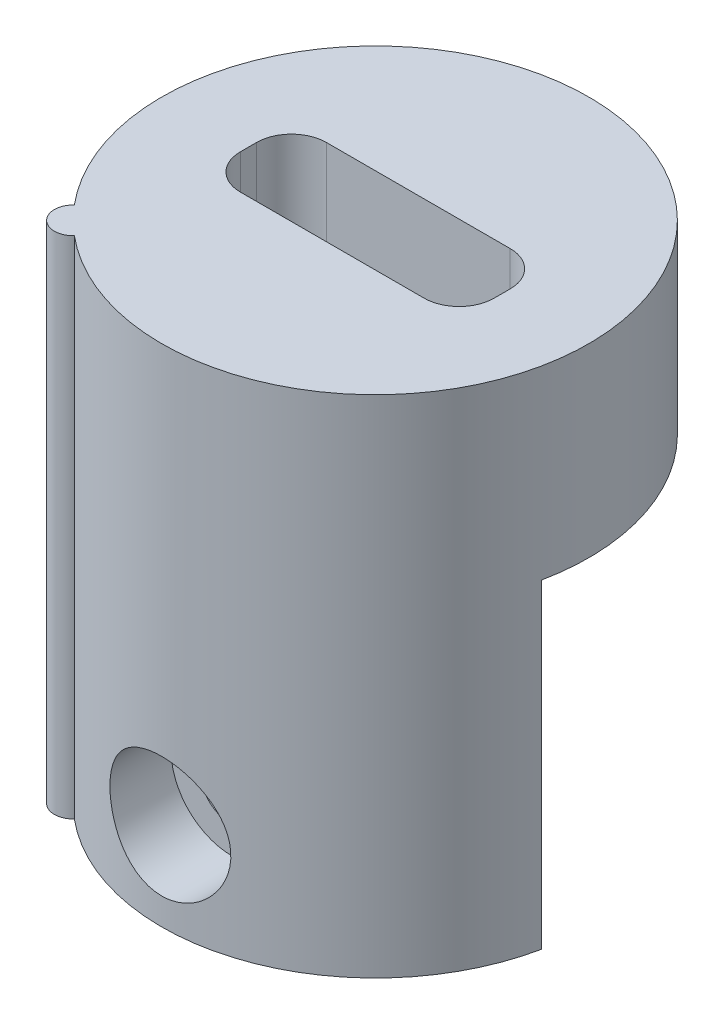
ISO-10303-21;
HEADER;
FILE_DESCRIPTION(('STEP AP214'),'2;1');
FILE_NAME('part.step','',(''),(''),'','','');
FILE_SCHEMA(('AUTOMOTIVE_DESIGN { 1 0 10303 214 1 1 1 1 }'));
ENDSEC;
DATA;
#1=APPLICATION_CONTEXT('core data for automotive mechanical design processes');
#2=APPLICATION_PROTOCOL_DEFINITION('international standard','automotive_design',2000,#1);
#3=PRODUCT_CONTEXT('',#1,'mechanical');
#4=PRODUCT('Part','Part','',(#3));
#5=PRODUCT_RELATED_PRODUCT_CATEGORY('part','',(#4));
#6=PRODUCT_DEFINITION_FORMATION('','',#4);
#7=PRODUCT_DEFINITION_CONTEXT('part definition',#1,'design');
#8=PRODUCT_DEFINITION('design','',#6,#7);
#9=PRODUCT_DEFINITION_SHAPE('','',#8);
#10=(LENGTH_UNIT() NAMED_UNIT(*) SI_UNIT(.MILLI.,.METRE.));
#11=(NAMED_UNIT(*) PLANE_ANGLE_UNIT() SI_UNIT($,.RADIAN.));
#12=(NAMED_UNIT(*) SI_UNIT($,.STERADIAN.) SOLID_ANGLE_UNIT());
#13=UNCERTAINTY_MEASURE_WITH_UNIT(LENGTH_MEASURE(1.E-05),#10,'distance_accuracy_value','');
#14=(GEOMETRIC_REPRESENTATION_CONTEXT(3) GLOBAL_UNCERTAINTY_ASSIGNED_CONTEXT((#13)) GLOBAL_UNIT_ASSIGNED_CONTEXT((#10,
#11,#12)) REPRESENTATION_CONTEXT('',''));
#15=CARTESIAN_POINT('',(0.,0.,0.));
#16=DIRECTION('',(0.,0.,1.));
#17=DIRECTION('',(1.,0.,0.));
#18=AXIS2_PLACEMENT_3D('',#15,#16,#17);
#19=CARTESIAN_POINT('',(0.,37.9987213115874,0.));
#20=DIRECTION('',(0.,-1.,0.));
#21=DIRECTION('',(0.,0.,-1.));
#22=AXIS2_PLACEMENT_3D('',#19,#20,#21);
#23=CYLINDRICAL_SURFACE('',#22,7.05);
#24=DIRECTION('',(0.,-1.,0.));
#25=VECTOR('',#24,1.);
#26=CARTESIAN_POINT('',(-6.86603961538236,37.9987213115874,1.6));
#27=LINE('',#26,#25);
#28=CARTESIAN_POINT('',(-6.86603961538236,11.9,1.6));
#29=VERTEX_POINT('',#28);
#30=CARTESIAN_POINT('',(-6.86603961538236,0.,1.6));
#31=VERTEX_POINT('',#30);
#32=EDGE_CURVE('E198',#29,#31,#27,.T.);
#33=ORIENTED_EDGE('',*,*,#32,.F.);
#34=CARTESIAN_POINT('',(0.,11.9,0.));
#35=DIRECTION('',(0.,1.,0.));
#36=DIRECTION('',(0.,0.,1.));
#37=AXIS2_PLACEMENT_3D('',#34,#35,#36);
#38=CIRCLE('',#37,7.05);
#39=CARTESIAN_POINT('',(6.86603961538236,11.9,1.6));
#40=VERTEX_POINT('',#39);
#41=EDGE_CURVE('E205',#29,#40,#38,.T.);
#42=ORIENTED_EDGE('',*,*,#41,.T.);
#43=DIRECTION('',(0.,-1.,0.));
#44=VECTOR('',#43,1.);
#45=CARTESIAN_POINT('',(6.86603961538236,37.9987213115874,1.6));
#46=LINE('',#45,#44);
#47=CARTESIAN_POINT('',(6.86603961538236,0.,1.6));
#48=VERTEX_POINT('',#47);
#49=EDGE_CURVE('E192',#48,#40,#46,.F.);
#50=ORIENTED_EDGE('',*,*,#49,.F.);
#51=CARTESIAN_POINT('',(0.,0.,0.));
#52=DIRECTION('',(0.,1.,0.));
#53=DIRECTION('',(0.,0.,1.));
#54=AXIS2_PLACEMENT_3D('',#51,#52,#53);
#55=CIRCLE('',#54,7.05);
#56=CARTESIAN_POINT('',(2.25,0.,6.68131723539603));
#57=VERTEX_POINT('',#56);
#58=EDGE_CURVE('E216',#57,#48,#55,.T.);
#59=ORIENTED_EDGE('',*,*,#58,.F.);
#60=DIRECTION('',(0.,-1.,0.));
#61=VECTOR('',#60,1.);
#62=CARTESIAN_POINT('',(2.25,6.4,6.68131723539603));
#63=LINE('',#62,#61);
#64=CARTESIAN_POINT('',(2.25,1.1408739718026,6.68131723539603));
#65=VERTEX_POINT('',#64);
#66=EDGE_CURVE('E320',#65,#57,#63,.T.);
#67=ORIENTED_EDGE('',*,*,#66,.F.);
#68=CARTESIAN_POINT('',(1.66733320005331,5.75391855782443,6.85));
#69=CARTESIAN_POINT('',(1.74060140182328,5.70607955480565,6.83216920240075));
#70=CARTESIAN_POINT('',(1.81164965876598,5.65520244872874,6.81362663385331));
#71=CARTESIAN_POINT('',(1.94896923535859,5.54768684113123,6.77562446894652));
#72=CARTESIAN_POINT('',(2.0152411243713,5.49104902825796,6.75616498234646));
#73=CARTESIAN_POINT('',(2.20656817877217,5.31280312894442,6.69711589323302));
#74=CARTESIAN_POINT('',(2.32395389828211,5.18298108772871,6.65690174010533));
#75=CARTESIAN_POINT('',(2.53520422911894,4.90464448061897,6.57935839425873));
#76=CARTESIAN_POINT('',(2.62905765286788,4.75612107405074,6.5420305795551));
#77=CARTESIAN_POINT('',(2.79034668981263,4.44388905276111,6.47488366750186));
#78=CARTESIAN_POINT('',(2.8578108066843,4.28019705975398,6.44505648106713));
#79=CARTESIAN_POINT('',(2.96190910147016,3.94761464935933,6.39787391541724));
#80=CARTESIAN_POINT('',(2.9994952177959,3.77907892422389,6.3801362556086));
#81=CARTESIAN_POINT('',(3.04563958401764,3.43722082276321,6.35824453569025));
#82=CARTESIAN_POINT('',(3.05421291189618,3.26390097998265,6.35408341987395));
#83=CARTESIAN_POINT('',(3.04245670626433,2.93398896452825,6.35971334303641));
#84=CARTESIAN_POINT('',(3.02462819465739,2.77727913237544,6.36829725251299));
#85=CARTESIAN_POINT('',(2.96535289182804,2.46940972846357,6.39611133477086));
#86=CARTESIAN_POINT('',(2.92390574090669,2.31825024127054,6.41534166969124));
#87=CARTESIAN_POINT('',(2.81865239787285,2.02431760018763,6.46227556856702));
#88=CARTESIAN_POINT('',(2.75471045990992,1.88160164823009,6.49003044217454));
#89=CARTESIAN_POINT('',(2.60644252961961,1.60840888666788,6.55098326925265));
#90=CARTESIAN_POINT('',(2.52210065074101,1.47794172632928,6.5841854583318));
#91=CARTESIAN_POINT('',(2.32308645913269,1.21604529373514,6.65720071242586));
#92=CARTESIAN_POINT('',(2.20593101782435,1.08656787115998,6.69731953188111));
#93=CARTESIAN_POINT('',(2.01493723609454,0.908685675557565,6.7562552501142));
#94=CARTESIAN_POINT('',(1.94871608550168,0.852105334203414,6.77569674754619));
#95=CARTESIAN_POINT('',(1.81151362170668,0.744700671307594,6.81366205077588));
#96=CARTESIAN_POINT('',(1.74053223068432,0.693876443903178,6.83218584156235));
#97=CARTESIAN_POINT('',(1.66733320005331,0.646081442175573,6.85));
#98=B_SPLINE_CURVE_WITH_KNOTS('',3,(#68,#69,#70,#71,#72,#73,#74,#75,#76,#77,#78,#79,#80,#81,#82,
#83,#84,#85,#86,#87,#88,#89,#90,#91,#92,#93,#94,#95,#96,#97),.UNSPECIFIED.,.F.,.F.,(4,2,2,2,2,2,
2,2,2,2,2,2,2,2,4),(0.,0.267724403057944,0.535416839293612,1.07145655450831,1.6077506292482,
2.14346383067559,2.66133550981283,3.17893800902237,3.65053860870523,4.12214639079864,
4.59665036006512,5.071525048092,5.60626041279744,5.87372313705406,6.14119023484664),.UNSPECIFIED.);
#99=CARTESIAN_POINT('',(2.25,5.2591260281974,6.68131723539603));
#100=VERTEX_POINT('',#99);
#101=EDGE_CURVE('E305',#100,#65,#98,.T.);
#102=ORIENTED_EDGE('',*,*,#101,.F.);
#103=CARTESIAN_POINT('',(2.25,10.231317235396,6.68131723539602));
#104=VERTEX_POINT('',#103);
#105=EDGE_CURVE('E66',#104,#100,#63,.T.);
#106=ORIENTED_EDGE('',*,*,#105,.F.);
#107=CARTESIAN_POINT('',(0.,3.55000000000003,0.));
#108=DIRECTION('',(0.,0.707106781186551,-0.707106781186544));
#109=DIRECTION('',(0.,-0.707106781186544,-0.707106781186551));
#110=AXIS2_PLACEMENT_3D('',#107,#108,#109);
#111=ELLIPSE('',#110,9.97020561473027,7.05);
#112=CARTESIAN_POINT('',(-2.25,10.231317235396,6.68131723539602));
#113=VERTEX_POINT('',#112);
#114=EDGE_CURVE('E379',#113,#104,#111,.T.);
#115=ORIENTED_EDGE('',*,*,#114,.F.);
#116=DIRECTION('',(0.,-1.,0.));
#117=VECTOR('',#116,1.);
#118=CARTESIAN_POINT('',(-2.25,6.4,6.68131723539603));
#119=LINE('',#118,#117);
#120=CARTESIAN_POINT('',(-2.25,5.2591260281974,6.68131723539603));
#121=VERTEX_POINT('',#120);
#122=EDGE_CURVE('E327',#113,#121,#119,.T.);
#123=ORIENTED_EDGE('',*,*,#122,.T.);
#124=CARTESIAN_POINT('',(-1.66733320005331,0.646081442175573,6.85));
#125=CARTESIAN_POINT('',(-1.74060140182328,0.693920445194346,6.83216920240076));
#126=CARTESIAN_POINT('',(-1.81164965876598,0.74479755127126,6.81362663385331));
#127=CARTESIAN_POINT('',(-1.94896923535859,0.852313158868773,6.77562446894652));
#128=CARTESIAN_POINT('',(-2.0152411243713,0.908950971742036,6.75616498234646));
#129=CARTESIAN_POINT('',(-2.20656817877217,1.08719687105558,6.69711589323302));
#130=CARTESIAN_POINT('',(-2.32395389828211,1.21701891227129,6.65690174010533));
#131=CARTESIAN_POINT('',(-2.53520422911894,1.49535551938103,6.57935839425873));
#132=CARTESIAN_POINT('',(-2.62905765286789,1.64387892594926,6.5420305795551));
#133=CARTESIAN_POINT('',(-2.79034668981263,1.9561109472389,6.47488366750186));
#134=CARTESIAN_POINT('',(-2.8578108066843,2.11980294024602,6.44505648106713));
#135=CARTESIAN_POINT('',(-2.96190910147016,2.45238535064067,6.39787391541724));
#136=CARTESIAN_POINT('',(-2.9994952177959,2.62092107577611,6.3801362556086));
#137=CARTESIAN_POINT('',(-3.04563958401764,2.96277917723679,6.35824453569025));
#138=CARTESIAN_POINT('',(-3.05421291189618,3.13609902001735,6.35408341987395));
#139=CARTESIAN_POINT('',(-3.04245670626433,3.46601103547176,6.35971334303641));
#140=CARTESIAN_POINT('',(-3.02462819465739,3.62272086762456,6.36829725251299));
#141=CARTESIAN_POINT('',(-2.96535289182803,3.93059027153643,6.39611133477086));
#142=CARTESIAN_POINT('',(-2.92390574090669,4.08174975872947,6.41534166969124));
#143=CARTESIAN_POINT('',(-2.81865239787285,4.37568239981238,6.46227556856702));
#144=CARTESIAN_POINT('',(-2.75471045990992,4.51839835176991,6.49003044217454));
#145=CARTESIAN_POINT('',(-2.60644252961961,4.79159111333212,6.55098326925265));
#146=CARTESIAN_POINT('',(-2.52210065074101,4.92205827367072,6.5841854583318));
#147=CARTESIAN_POINT('',(-2.32308645913269,5.18395470626487,6.65720071242586));
#148=CARTESIAN_POINT('',(-2.20593101782435,5.31343212884002,6.69731953188111));
#149=CARTESIAN_POINT('',(-2.01493723609454,5.49131432444244,6.7562552501142));
#150=CARTESIAN_POINT('',(-1.94871608550168,5.54789466579659,6.77569674754619));
#151=CARTESIAN_POINT('',(-1.81151362170667,5.65529932869241,6.81366205077588));
#152=CARTESIAN_POINT('',(-1.74053223068431,5.70612355609682,6.83218584156235));
#153=CARTESIAN_POINT('',(-1.6673332000533,5.75391855782443,6.85));
#154=B_SPLINE_CURVE_WITH_KNOTS('',3,(#124,#125,#126,#127,#128,#129,#130,#131,#132,#133,#134,
#135,#136,#137,#138,#139,#140,#141,#142,#143,#144,#145,#146,#147,#148,#149,#150,#151,#152,#153),
.UNSPECIFIED.,.F.,.F.,(4,2,2,2,2,2,2,2,2,2,2,2,2,2,4),(0.,0.267724403057944,0.535416839293612,
1.07145655450831,1.60775062924821,2.14346383067559,2.66133550981283,3.17893800902238,
3.65053860870523,4.12214639079864,4.59665036006512,5.07152504809201,5.60626041279744,
5.87372313705406,6.14119023484664),.UNSPECIFIED.);
#155=CARTESIAN_POINT('',(-2.25,1.1408739718026,6.68131723539603));
#156=VERTEX_POINT('',#155);
#157=EDGE_CURVE('E346',#156,#121,#154,.T.);
#158=ORIENTED_EDGE('',*,*,#157,.F.);
#159=CARTESIAN_POINT('',(-2.25,0.,6.68131723539603));
#160=VERTEX_POINT('',#159);
#161=EDGE_CURVE('E326',#156,#160,#119,.T.);
#162=ORIENTED_EDGE('',*,*,#161,.T.);
#163=EDGE_CURVE('E213',#31,#160,#55,.T.);
#164=ORIENTED_EDGE('',*,*,#163,.F.);
#165=EDGE_LOOP('',(#33,#42,#50,#59,#67,#102,#106,#115,#123,#158,#162,#164));
#166=FACE_BOUND('',#165,.T.);
#167=ADVANCED_FACE('F39',(#166),#23,.F.);
#168=CARTESIAN_POINT('',(-2.25,6.4,0.));
#169=DIRECTION('',(1.,0.,0.));
#170=DIRECTION('',(0.,0.,-1.));
#171=AXIS2_PLACEMENT_3D('',#168,#169,#170);
#172=PLANE('',#171);
#173=ORIENTED_EDGE('',*,*,#161,.F.);
#174=DIRECTION('',(0.,0.,-1.));
#175=VECTOR('',#174,1.);
#176=CARTESIAN_POINT('',(-2.25,1.1408739718026,6.85));
#177=LINE('',#176,#175);
#178=CARTESIAN_POINT('',(-2.25,1.1408739718026,2.85));
#179=VERTEX_POINT('',#178);
#180=EDGE_CURVE('E338',#156,#179,#177,.T.);
#181=ORIENTED_EDGE('',*,*,#180,.T.);
#182=DIRECTION('',(0.,-1.,0.));
#183=VECTOR('',#182,1.);
#184=CARTESIAN_POINT('',(-2.25,6.4,2.85));
#185=LINE('',#184,#183);
#186=CARTESIAN_POINT('',(-2.25,0.,2.85));
#187=VERTEX_POINT('',#186);
#188=EDGE_CURVE('E218',#179,#187,#185,.T.);
#189=ORIENTED_EDGE('',*,*,#188,.T.);
#190=DIRECTION('',(0.,0.,1.));
#191=VECTOR('',#190,1.);
#192=CARTESIAN_POINT('',(-2.25,0.,0.));
#193=LINE('',#192,#191);
#194=EDGE_CURVE('E322',#187,#160,#193,.T.);
#195=ORIENTED_EDGE('',*,*,#194,.T.);
#196=EDGE_LOOP('',(#173,#181,#189,#195));
#197=FACE_BOUND('',#196,.T.);
#198=ADVANCED_FACE('F461',(#197),#172,.F.);
#199=CARTESIAN_POINT('',(2.25,6.4,0.));
#200=DIRECTION('',(1.,0.,0.));
#201=DIRECTION('',(0.,0.,-1.));
#202=AXIS2_PLACEMENT_3D('',#199,#200,#201);
#203=PLANE('',#202);
#204=DIRECTION('',(0.,0.,-1.));
#205=VECTOR('',#204,1.);
#206=CARTESIAN_POINT('',(2.25,1.1408739718026,6.85));
#207=LINE('',#206,#205);
#208=CARTESIAN_POINT('',(2.25,1.1408739718026,2.85));
#209=VERTEX_POINT('',#208);
#210=EDGE_CURVE('E51',#65,#209,#207,.T.);
#211=ORIENTED_EDGE('',*,*,#210,.F.);
#212=ORIENTED_EDGE('',*,*,#66,.T.);
#213=DIRECTION('',(0.,0.,1.));
#214=VECTOR('',#213,1.);
#215=CARTESIAN_POINT('',(2.25,0.,0.));
#216=LINE('',#215,#214);
#217=CARTESIAN_POINT('',(2.25,0.,2.85));
#218=VERTEX_POINT('',#217);
#219=EDGE_CURVE('E313',#218,#57,#216,.T.);
#220=ORIENTED_EDGE('',*,*,#219,.F.);
#221=DIRECTION('',(0.,-1.,0.));
#222=VECTOR('',#221,1.);
#223=CARTESIAN_POINT('',(2.25,6.4,2.85));
#224=LINE('',#223,#222);
#225=EDGE_CURVE('E310',#209,#218,#224,.T.);
#226=ORIENTED_EDGE('',*,*,#225,.F.);
#227=EDGE_LOOP('',(#211,#212,#220,#226));
#228=FACE_BOUND('',#227,.T.);
#229=ADVANCED_FACE('F311',(#228),#203,.T.);
#230=CARTESIAN_POINT('',(-2.8107494552165,0.,2.81074945521655));
#231=DIRECTION('',(0.,1.,0.));
#232=DIRECTION('',(0.,0.,1.));
#233=AXIS2_PLACEMENT_3D('',#230,#231,#232);
#234=PLANE('',#233);
#235=CARTESIAN_POINT('',(0.,0.,0.));
#236=DIRECTION('',(0.,1.,0.));
#237=DIRECTION('',(0.,0.,1.));
#238=AXIS2_PLACEMENT_3D('',#235,#236,#237);
#239=CIRCLE('',#238,7.95);
#240=CARTESIAN_POINT('',(-7.7873294523861,0.,1.6));
#241=VERTEX_POINT('',#240);
#242=CARTESIAN_POINT('',(-6.09420239994207,0.,5.10521273881317));
#243=VERTEX_POINT('',#242);
#244=EDGE_CURVE('E287',#241,#243,#239,.T.);
#245=ORIENTED_EDGE('',*,*,#244,.F.);
#246=DIRECTION('',(-1.,0.,0.));
#247=VECTOR('',#246,1.);
#248=CARTESIAN_POINT('',(7.95,0.,1.6));
#249=LINE('',#248,#247);
#250=EDGE_CURVE('E392',#31,#241,#249,.T.);
#251=ORIENTED_EDGE('',*,*,#250,.F.);
#252=ORIENTED_EDGE('',*,*,#163,.T.);
#253=ORIENTED_EDGE('',*,*,#194,.F.);
#254=DIRECTION('',(-1.,0.,0.));
#255=VECTOR('',#254,1.);
#256=CARTESIAN_POINT('',(0.,0.,2.85));
#257=LINE('',#256,#255);
#258=EDGE_CURVE('E333',#218,#187,#257,.T.);
#259=ORIENTED_EDGE('',*,*,#258,.F.);
#260=ORIENTED_EDGE('',*,*,#219,.T.);
#261=ORIENTED_EDGE('',*,*,#58,.T.);
#262=CARTESIAN_POINT('',(7.7873294523861,0.,1.6));
#263=VERTEX_POINT('',#262);
#264=EDGE_CURVE('E195',#263,#48,#249,.T.);
#265=ORIENTED_EDGE('',*,*,#264,.F.);
#266=CARTESIAN_POINT('',(-5.10521273881307,0.,6.09420239994215));
#267=VERTEX_POINT('',#266);
#268=EDGE_CURVE('E282',#267,#263,#239,.T.);
#269=ORIENTED_EDGE('',*,*,#268,.F.);
#270=CARTESIAN_POINT('',(-5.621498910433,0.,5.6214989104331));
#271=DIRECTION('',(0.,1.,0.));
#272=DIRECTION('',(0.,0.,1.));
#273=AXIS2_PLACEMENT_3D('',#270,#271,#272);
#274=CIRCLE('',#273,0.7);
#275=EDGE_CURVE('E277',#243,#267,#274,.T.);
#276=ORIENTED_EDGE('',*,*,#275,.F.);
#277=EDGE_LOOP('',(#245,#251,#252,#253,#259,#260,#261,#265,#269,#276));
#278=FACE_BOUND('',#277,.T.);
#279=ADVANCED_FACE('F403',(#278),#234,.F.);
#280=CARTESIAN_POINT('',(-2.8107494552165,18.8,2.81074945521655));
#281=DIRECTION('',(0.,1.,0.));
#282=DIRECTION('',(0.,0.,1.));
#283=AXIS2_PLACEMENT_3D('',#280,#281,#282);
#284=PLANE('',#283);
#285=CARTESIAN_POINT('',(-5.621498910433,18.8,5.6214989104331));
#286=DIRECTION('',(0.,1.,0.));
#287=DIRECTION('',(0.,0.,1.));
#288=AXIS2_PLACEMENT_3D('',#285,#286,#287);
#289=CIRCLE('',#288,0.7);
#290=CARTESIAN_POINT('',(-6.09420239994207,18.8,5.10521273881317));
#291=VERTEX_POINT('',#290);
#292=CARTESIAN_POINT('',(-5.10521273881307,18.8,6.09420239994215));
#293=VERTEX_POINT('',#292);
#294=EDGE_CURVE('E278',#291,#293,#289,.T.);
#295=ORIENTED_EDGE('',*,*,#294,.T.);
#296=CARTESIAN_POINT('',(0.,18.8,0.));
#297=DIRECTION('',(0.,1.,0.));
#298=DIRECTION('',(0.,0.,1.));
#299=AXIS2_PLACEMENT_3D('',#296,#297,#298);
#300=CIRCLE('',#299,7.95);
#301=EDGE_CURVE('E281',#293,#291,#300,.T.);
#302=ORIENTED_EDGE('',*,*,#301,.T.);
#303=EDGE_LOOP('',(#295,#302));
#304=FACE_BOUND('',#303,.T.);
#305=DIRECTION('',(-1.,0.,0.));
#306=VECTOR('',#305,1.);
#307=CARTESIAN_POINT('',(-3.42,18.8,-1.6));
#308=LINE('',#307,#306);
#309=CARTESIAN_POINT('',(3.42,18.8,-1.6));
#310=VERTEX_POINT('',#309);
#311=CARTESIAN_POINT('',(-3.42,18.8,-1.6));
#312=VERTEX_POINT('',#311);
#313=EDGE_CURVE('E238',#310,#312,#308,.T.);
#314=ORIENTED_EDGE('',*,*,#313,.F.);
#315=CARTESIAN_POINT('',(3.42,18.8,-0.3));
#316=DIRECTION('',(0.,1.,0.));
#317=DIRECTION('',(0.,0.,1.));
#318=AXIS2_PLACEMENT_3D('',#315,#316,#317);
#319=CIRCLE('',#318,1.3);
#320=CARTESIAN_POINT('',(4.72,18.8,-0.3));
#321=VERTEX_POINT('',#320);
#322=EDGE_CURVE('E236',#321,#310,#319,.T.);
#323=ORIENTED_EDGE('',*,*,#322,.F.);
#324=DIRECTION('',(0.,0.,-1.));
#325=VECTOR('',#324,1.);
#326=CARTESIAN_POINT('',(4.72,18.8,0.3));
#327=LINE('',#326,#325);
#328=CARTESIAN_POINT('',(4.72,18.8,0.3));
#329=VERTEX_POINT('',#328);
#330=EDGE_CURVE('E251',#329,#321,#327,.T.);
#331=ORIENTED_EDGE('',*,*,#330,.F.);
#332=CARTESIAN_POINT('',(3.42,18.8,0.3));
#333=DIRECTION('',(0.,1.,0.));
#334=DIRECTION('',(0.,0.,1.));
#335=AXIS2_PLACEMENT_3D('',#332,#333,#334);
#336=CIRCLE('',#335,1.3);
#337=CARTESIAN_POINT('',(3.42,18.8,1.6));
#338=VERTEX_POINT('',#337);
#339=EDGE_CURVE('E248',#338,#329,#336,.T.);
#340=ORIENTED_EDGE('',*,*,#339,.F.);
#341=DIRECTION('',(1.,0.,0.));
#342=VECTOR('',#341,1.);
#343=CARTESIAN_POINT('',(-3.42,18.8,1.6));
#344=LINE('',#343,#342);
#345=CARTESIAN_POINT('',(-3.42,18.8,1.6));
#346=VERTEX_POINT('',#345);
#347=EDGE_CURVE('E246',#346,#338,#344,.T.);
#348=ORIENTED_EDGE('',*,*,#347,.F.);
#349=CARTESIAN_POINT('',(-3.42,18.8,0.3));
#350=DIRECTION('',(0.,1.,0.));
#351=DIRECTION('',(0.,0.,1.));
#352=AXIS2_PLACEMENT_3D('',#349,#350,#351);
#353=CIRCLE('',#352,1.3);
#354=CARTESIAN_POINT('',(-4.72,18.8,0.3));
#355=VERTEX_POINT('',#354);
#356=EDGE_CURVE('E244',#355,#346,#353,.T.);
#357=ORIENTED_EDGE('',*,*,#356,.F.);
#358=DIRECTION('',(0.,0.,1.));
#359=VECTOR('',#358,1.);
#360=CARTESIAN_POINT('',(-4.72,18.8,0.3));
#361=LINE('',#360,#359);
#362=CARTESIAN_POINT('',(-4.72,18.8,-0.3));
#363=VERTEX_POINT('',#362);
#364=EDGE_CURVE('E242',#363,#355,#361,.T.);
#365=ORIENTED_EDGE('',*,*,#364,.F.);
#366=CARTESIAN_POINT('',(-3.42,18.8,-0.3));
#367=DIRECTION('',(0.,1.,0.));
#368=DIRECTION('',(0.,0.,1.));
#369=AXIS2_PLACEMENT_3D('',#366,#367,#368);
#370=CIRCLE('',#369,1.3);
#371=EDGE_CURVE('E240',#312,#363,#370,.T.);
#372=ORIENTED_EDGE('',*,*,#371,.F.);
#373=EDGE_LOOP('',(#314,#323,#331,#340,#348,#357,#365,#372));
#374=FACE_BOUND('',#373,.T.);
#375=ADVANCED_FACE('F408',(#304,#374),#284,.T.);
#376=CARTESIAN_POINT('',(-5.621498910433,18.8,5.6214989104331));
#377=DIRECTION('',(0.,-1.,0.));
#378=DIRECTION('',(0.,0.,-1.));
#379=AXIS2_PLACEMENT_3D('',#376,#377,#378);
#380=CYLINDRICAL_SURFACE('',#379,0.7);
#381=ORIENTED_EDGE('',*,*,#275,.T.);
#382=DIRECTION('',(0.,-1.,0.));
#383=VECTOR('',#382,1.);
#384=CARTESIAN_POINT('',(-5.10521273881307,18.8,6.09420239994215));
#385=LINE('',#384,#383);
#386=EDGE_CURVE('E292',#293,#267,#385,.T.);
#387=ORIENTED_EDGE('',*,*,#386,.F.);
#388=ORIENTED_EDGE('',*,*,#294,.F.);
#389=DIRECTION('',(0.,-1.,0.));
#390=VECTOR('',#389,1.);
#391=CARTESIAN_POINT('',(-6.09420239994207,18.8,5.10521273881317));
#392=LINE('',#391,#390);
#393=EDGE_CURVE('E284',#291,#243,#392,.T.);
#394=ORIENTED_EDGE('',*,*,#393,.T.);
#395=EDGE_LOOP('',(#381,#387,#388,#394));
#396=FACE_BOUND('',#395,.T.);
#397=ADVANCED_FACE('F41',(#396),#380,.T.);
#398=CARTESIAN_POINT('',(0.,18.8,0.));
#399=DIRECTION('',(0.,-1.,0.));
#400=DIRECTION('',(0.,0.,-1.));
#401=AXIS2_PLACEMENT_3D('',#398,#399,#400);
#402=CYLINDRICAL_SURFACE('',#401,7.95);
#403=CARTESIAN_POINT('',(0.,1.,7.95));
#404=CARTESIAN_POINT('',(-0.12374822841081,1.00000229986687,7.94999846345168));
#405=CARTESIAN_POINT('',(-0.247520225331084,1.01024314784028,7.94708258378666));
#406=CARTESIAN_POINT('',(-0.491480033194995,1.05085173637755,7.93573450376269));
#407=CARTESIAN_POINT('',(-0.611666415141608,1.08122739230805,7.92730013399974));
#408=CARTESIAN_POINT('',(-0.844899666381789,1.1610249315285,7.90584280251306));
#409=CARTESIAN_POINT('',(-0.9579561329722,1.21042054720932,7.89282617126104));
#410=CARTESIAN_POINT('',(-1.17418135526541,1.32675347470097,7.86356902990932));
#411=CARTESIAN_POINT('',(-1.27734912825357,1.39369252747317,7.847328199888));
#412=CARTESIAN_POINT('',(-1.47353445057824,1.54503696611995,7.81289674412953));
#413=CARTESIAN_POINT('',(-1.56626016193966,1.62981233309389,7.79466955870081));
#414=CARTESIAN_POINT('',(-1.73638648420002,1.81363321267566,7.75854635111244));
#415=CARTESIAN_POINT('',(-1.813784846512,1.91268081540403,7.74065037789162));
#416=CARTESIAN_POINT('',(-1.95253567488759,2.12463049065565,7.70683589990849));
#417=CARTESIAN_POINT('',(-2.01354268249899,2.23776670058826,7.69096320054954));
#418=CARTESIAN_POINT('',(-2.1155501431307,2.47321333276067,7.66353426617664));
#419=CARTESIAN_POINT('',(-2.15655480947743,2.5955218166696,7.65197712224732));
#420=CARTESIAN_POINT('',(-2.2163615097911,2.84258674145662,7.6348669930321));
#421=CARTESIAN_POINT('',(-2.23569701611231,2.96720382063505,7.62917004068343));
#422=CARTESIAN_POINT('',(-2.2532810730701,3.21803322439911,7.62399604743461));
#423=CARTESIAN_POINT('',(-2.25153411070258,3.34424520382901,7.62451768302794));
#424=CARTESIAN_POINT('',(-2.2274241796868,3.59043639050049,7.63159366975232));
#425=CARTESIAN_POINT('',(-2.20571738165692,3.71048627146515,7.63795599982056));
#426=CARTESIAN_POINT('',(-2.14335928518361,3.94516598879601,7.65568752215646));
#427=CARTESIAN_POINT('',(-2.10270630291911,4.05979534242129,7.66705715943804));
#428=CARTESIAN_POINT('',(-2.00309996670399,4.28203994588632,7.69368354283954));
#429=CARTESIAN_POINT('',(-1.94392486292897,4.38954998154264,7.70898696523494));
#430=CARTESIAN_POINT('',(-1.8091084310371,4.59333968522977,7.74173279445377));
#431=CARTESIAN_POINT('',(-1.73346349791949,4.68961688746314,7.75917566920595));
#432=CARTESIAN_POINT('',(-1.56454543399123,4.87194434010967,7.79502459000905));
#433=CARTESIAN_POINT('',(-1.47072428705999,4.95748535447912,7.81344241226734));
#434=CARTESIAN_POINT('',(-1.26984067985834,5.1117307586363,7.8485914167815));
#435=CARTESIAN_POINT('',(-1.1627775591544,5.18043430815819,7.86532251483768));
#436=CARTESIAN_POINT('',(-0.937595509425775,5.29931862201452,7.89533842180538));
#437=CARTESIAN_POINT('',(-0.819419992683546,5.3493973437355,7.90860412983086));
#438=CARTESIAN_POINT('',(-0.575863843698626,5.42882460243431,7.93005689409277));
#439=CARTESIAN_POINT('',(-0.450485000497598,5.45817826289366,7.93824520546103));
#440=CARTESIAN_POINT('',(-0.200419078528649,5.49449967996815,7.94842658296418));
#441=CARTESIAN_POINT('',(-0.075840037697388,5.50215870131466,7.95061088763692));
#442=CARTESIAN_POINT('',(0.172826076828103,5.49679603385323,7.94909331431023));
#443=CARTESIAN_POINT('',(0.296913206631011,5.48377677592894,7.94539212819341));
#444=CARTESIAN_POINT('',(0.538538247519877,5.43799058777401,7.93264383515759));
#445=CARTESIAN_POINT('',(0.656157041231901,5.405617983527,7.92370354546215));
#446=CARTESIAN_POINT('',(0.884276469064895,5.32250980563676,7.90149991626862));
#447=CARTESIAN_POINT('',(0.994776285041625,5.27177212581709,7.8882360809473));
#448=CARTESIAN_POINT('',(1.20813942832733,5.15215054194238,7.8584196913278));
#449=CARTESIAN_POINT('',(1.31078921172128,5.08290216674771,7.8418029387437));
#450=CARTESIAN_POINT('',(1.50325090677457,4.92867557187695,7.80719633342785));
#451=CARTESIAN_POINT('',(1.59305994553626,4.84369384186049,7.78920617479665));
#452=CARTESIAN_POINT('',(1.76026762330028,4.65717429404539,7.75316180136207));
#453=CARTESIAN_POINT('',(1.83717626244011,4.55519315045356,7.73512401276345));
#454=CARTESIAN_POINT('',(1.97281053649798,4.33938418013164,7.70165028098548));
#455=CARTESIAN_POINT('',(2.03153682714318,4.22555678082209,7.68621424398589));
#456=CARTESIAN_POINT('',(2.12870787423237,3.98977542225886,7.65987202966338));
#457=CARTESIAN_POINT('',(2.16726199801316,3.86786940915725,7.6489414949015));
#458=CARTESIAN_POINT('',(2.22320665823109,3.61893603502634,7.63287073299596));
#459=CARTESIAN_POINT('',(2.24060345755429,3.49191020104951,7.62772879237494));
#460=CARTESIAN_POINT('',(2.25334706915912,3.24139365829508,7.62397304923113));
#461=CARTESIAN_POINT('',(2.24948653650275,3.11794622399765,7.62512456081771));
#462=CARTESIAN_POINT('',(2.22168924732377,2.87353916444024,7.63326942775173));
#463=CARTESIAN_POINT('',(2.19775313734075,2.75257945919076,7.64026259496699));
#464=CARTESIAN_POINT('',(2.13096952309713,2.51772079636048,7.65915440520456));
#465=CARTESIAN_POINT('',(2.08830997272649,2.40376418219718,7.67100421879537));
#466=CARTESIAN_POINT('',(1.98543577379807,2.1845361565402,7.69827018179083));
#467=CARTESIAN_POINT('',(1.92521806734266,2.07926626201111,7.71368695231379));
#468=CARTESIAN_POINT('',(1.78661912449901,1.87666606246476,7.74698150117189));
#469=CARTESIAN_POINT('',(1.70770666031738,1.77970968928342,7.7649234399407));
#470=CARTESIAN_POINT('',(1.53494260828496,1.60015798614647,7.80091176778823));
#471=CARTESIAN_POINT('',(1.44108728421585,1.51756625867138,7.81895818189896));
#472=CARTESIAN_POINT('',(1.23827062826704,1.36704292300201,7.85366275078229));
#473=CARTESIAN_POINT('',(1.12899013306501,1.29952974931783,7.87027488206247));
#474=CARTESIAN_POINT('',(0.90016026922092,1.18393584097262,7.89971397958484));
#475=CARTESIAN_POINT('',(0.780616702731468,1.13584421306781,7.91254306658527));
#476=CARTESIAN_POINT('',(0.551490248909686,1.06580779667511,7.93156526177838));
#477=CARTESIAN_POINT('',(0.442772345055728,1.04119160004185,7.93842476591918));
#478=CARTESIAN_POINT('',(0.222709151405983,1.00828771370511,7.94764253783634));
#479=CARTESIAN_POINT('',(0.111364200358137,0.9999979302909,7.95000138277919));
#480=CARTESIAN_POINT('',(0.,1.,7.95));
#481=B_SPLINE_CURVE_WITH_KNOTS('',3,(#403,#404,#405,#406,#407,#408,#409,#410,#411,#412,#413,
#414,#415,#416,#417,#418,#419,#420,#421,#422,#423,#424,#425,#426,#427,#428,#429,#430,#431,#432,
#433,#434,#435,#436,#437,#438,#439,#440,#441,#442,#443,#444,#445,#446,#447,#448,#449,#450,#451,
#452,#453,#454,#455,#456,#457,#458,#459,#460,#461,#462,#463,#464,#465,#466,#467,#468,#469,#470,
#471,#472,#473,#474,#475,#476,#477,#478,#479,#480),.UNSPECIFIED.,.T.,.F.,(4,2,2,2,2,2,2,2,2,2,2,
2,2,2,2,2,2,2,2,2,2,2,2,2,2,2,2,2,2,2,2,2,2,2,2,2,2,2,4),(0.,0.370835970276312,
0.741817809581099,1.11228912963061,1.48279722814223,1.86192153971876,2.24110142929979,
2.62773759365739,3.01429228112509,3.39110568254921,3.76783888794007,4.13261351553197,
4.49742056824766,4.86677393211686,5.23620822336811,5.6192910381691,6.0023929666485,
6.38756396725758,6.77263971564539,7.14529960904547,7.51791569677956,7.88318675658873,
8.24849972034647,8.62161615392614,8.99481593575456,9.3799766572176,9.76512348664847,
10.1481599447752,10.5310829907331,10.8998264166489,11.2685579675355,11.6336697963474,
11.9988452504135,12.376004847772,12.7532588962615,13.1399505536936,13.5264250195336,
13.8601926129296,14.1939174009464),.UNSPECIFIED.);
#482=CARTESIAN_POINT('',(0.,1.,7.95));
#483=VERTEX_POINT('',#482);
#484=EDGE_CURVE('E12',#483,#483,#481,.T.);
#485=ORIENTED_EDGE('',*,*,#484,.T.);
#486=EDGE_LOOP('',(#485));
#487=FACE_BOUND('',#486,.T.);
#488=CARTESIAN_POINT('',(0.,11.9,0.));
#489=DIRECTION('',(0.,1.,0.));
#490=DIRECTION('',(0.,0.,1.));
#491=AXIS2_PLACEMENT_3D('',#488,#489,#490);
#492=CIRCLE('',#491,7.95);
#493=CARTESIAN_POINT('',(7.7873294523861,11.9,1.6));
#494=VERTEX_POINT('',#493);
#495=CARTESIAN_POINT('',(-7.7873294523861,11.9,1.6));
#496=VERTEX_POINT('',#495);
#497=EDGE_CURVE('E206',#494,#496,#492,.T.);
#498=ORIENTED_EDGE('',*,*,#497,.T.);
#499=DIRECTION('',(0.,-1.,0.));
#500=VECTOR('',#499,1.);
#501=CARTESIAN_POINT('',(-7.7873294523861,18.8,1.6));
#502=LINE('',#501,#500);
#503=EDGE_CURVE('E199',#496,#241,#502,.T.);
#504=ORIENTED_EDGE('',*,*,#503,.T.);
#505=ORIENTED_EDGE('',*,*,#244,.T.);
#506=ORIENTED_EDGE('',*,*,#393,.F.);
#507=ORIENTED_EDGE('',*,*,#301,.F.);
#508=ORIENTED_EDGE('',*,*,#386,.T.);
#509=ORIENTED_EDGE('',*,*,#268,.T.);
#510=DIRECTION('',(0.,-1.,0.));
#511=VECTOR('',#510,1.);
#512=CARTESIAN_POINT('',(7.7873294523861,18.8,1.6));
#513=LINE('',#512,#511);
#514=EDGE_CURVE('E208',#263,#494,#513,.F.);
#515=ORIENTED_EDGE('',*,*,#514,.T.);
#516=EDGE_LOOP('',(#498,#504,#505,#506,#507,#508,#509,#515));
#517=FACE_BOUND('',#516,.T.);
#518=ADVANCED_FACE('F400',(#487,#517),#402,.T.);
#519=CARTESIAN_POINT('',(3.42,18.8,-0.3));
#520=DIRECTION('',(0.,-1.,0.));
#521=DIRECTION('',(0.,0.,-1.));
#522=AXIS2_PLACEMENT_3D('',#519,#520,#521);
#523=CYLINDRICAL_SURFACE('',#522,1.3);
#524=CARTESIAN_POINT('',(3.42,11.9,-0.3));
#525=DIRECTION('',(0.,1.,0.));
#526=DIRECTION('',(0.,0.,1.));
#527=AXIS2_PLACEMENT_3D('',#524,#525,#526);
#528=CIRCLE('',#527,1.3);
#529=CARTESIAN_POINT('',(4.72,11.9,-0.3));
#530=VERTEX_POINT('',#529);
#531=CARTESIAN_POINT('',(3.42,11.9,-1.6));
#532=VERTEX_POINT('',#531);
#533=EDGE_CURVE('E234',#530,#532,#528,.T.);
#534=ORIENTED_EDGE('',*,*,#533,.F.);
#535=DIRECTION('',(0.,-1.,0.));
#536=VECTOR('',#535,1.);
#537=CARTESIAN_POINT('',(4.72,18.8,-0.3));
#538=LINE('',#537,#536);
#539=EDGE_CURVE('E253',#321,#530,#538,.T.);
#540=ORIENTED_EDGE('',*,*,#539,.F.);
#541=ORIENTED_EDGE('',*,*,#322,.T.);
#542=DIRECTION('',(0.,-1.,0.));
#543=VECTOR('',#542,1.);
#544=CARTESIAN_POINT('',(3.42,18.8,-1.6));
#545=LINE('',#544,#543);
#546=EDGE_CURVE('E274',#310,#532,#545,.T.);
#547=ORIENTED_EDGE('',*,*,#546,.T.);
#548=EDGE_LOOP('',(#534,#540,#541,#547));
#549=FACE_BOUND('',#548,.T.);
#550=ADVANCED_FACE('F451',(#549),#523,.F.);
#551=CARTESIAN_POINT('',(-3.42,18.8,-1.6));
#552=DIRECTION('',(0.,0.,1.));
#553=DIRECTION('',(1.,0.,0.));
#554=AXIS2_PLACEMENT_3D('',#551,#552,#553);
#555=PLANE('',#554);
#556=DIRECTION('',(-1.,0.,0.));
#557=VECTOR('',#556,1.);
#558=CARTESIAN_POINT('',(-3.42,11.9,-1.6));
#559=LINE('',#558,#557);
#560=CARTESIAN_POINT('',(-3.42,11.9,-1.6));
#561=VERTEX_POINT('',#560);
#562=EDGE_CURVE('E232',#532,#561,#559,.T.);
#563=ORIENTED_EDGE('',*,*,#562,.F.);
#564=ORIENTED_EDGE('',*,*,#546,.F.);
#565=ORIENTED_EDGE('',*,*,#313,.T.);
#566=DIRECTION('',(0.,-1.,0.));
#567=VECTOR('',#566,1.);
#568=CARTESIAN_POINT('',(-3.42,18.8,-1.6));
#569=LINE('',#568,#567);
#570=EDGE_CURVE('E271',#312,#561,#569,.T.);
#571=ORIENTED_EDGE('',*,*,#570,.T.);
#572=EDGE_LOOP('',(#563,#564,#565,#571));
#573=FACE_BOUND('',#572,.T.);
#574=ADVANCED_FACE('F421',(#573),#555,.T.);
#575=CARTESIAN_POINT('',(-3.42,18.8,-0.3));
#576=DIRECTION('',(0.,-1.,0.));
#577=DIRECTION('',(0.,0.,-1.));
#578=AXIS2_PLACEMENT_3D('',#575,#576,#577);
#579=CYLINDRICAL_SURFACE('',#578,1.3);
#580=CARTESIAN_POINT('',(-3.42,11.9,-0.3));
#581=DIRECTION('',(0.,1.,0.));
#582=DIRECTION('',(0.,0.,1.));
#583=AXIS2_PLACEMENT_3D('',#580,#581,#582);
#584=CIRCLE('',#583,1.3);
#585=CARTESIAN_POINT('',(-4.72,11.9,-0.3));
#586=VERTEX_POINT('',#585);
#587=EDGE_CURVE('E230',#561,#586,#584,.T.);
#588=ORIENTED_EDGE('',*,*,#587,.F.);
#589=ORIENTED_EDGE('',*,*,#570,.F.);
#590=ORIENTED_EDGE('',*,*,#371,.T.);
#591=DIRECTION('',(0.,-1.,0.));
#592=VECTOR('',#591,1.);
#593=CARTESIAN_POINT('',(-4.72,18.8,-0.3));
#594=LINE('',#593,#592);
#595=EDGE_CURVE('E268',#363,#586,#594,.T.);
#596=ORIENTED_EDGE('',*,*,#595,.T.);
#597=EDGE_LOOP('',(#588,#589,#590,#596));
#598=FACE_BOUND('',#597,.T.);
#599=ADVANCED_FACE('F424',(#598),#579,.F.);
#600=CARTESIAN_POINT('',(-4.72,18.8,0.3));
#601=DIRECTION('',(1.,0.,0.));
#602=DIRECTION('',(0.,0.,-1.));
#603=AXIS2_PLACEMENT_3D('',#600,#601,#602);
#604=PLANE('',#603);
#605=DIRECTION('',(0.,0.,1.));
#606=VECTOR('',#605,1.);
#607=CARTESIAN_POINT('',(-4.72,11.9,0.3));
#608=LINE('',#607,#606);
#609=CARTESIAN_POINT('',(-4.72,11.9,0.3));
#610=VERTEX_POINT('',#609);
#611=EDGE_CURVE('E228',#586,#610,#608,.T.);
#612=ORIENTED_EDGE('',*,*,#611,.F.);
#613=ORIENTED_EDGE('',*,*,#595,.F.);
#614=ORIENTED_EDGE('',*,*,#364,.T.);
#615=DIRECTION('',(0.,-1.,0.));
#616=VECTOR('',#615,1.);
#617=CARTESIAN_POINT('',(-4.72,18.8,0.3));
#618=LINE('',#617,#616);
#619=EDGE_CURVE('E265',#355,#610,#618,.T.);
#620=ORIENTED_EDGE('',*,*,#619,.T.);
#621=EDGE_LOOP('',(#612,#613,#614,#620));
#622=FACE_BOUND('',#621,.T.);
#623=ADVANCED_FACE('F430',(#622),#604,.T.);
#624=CARTESIAN_POINT('',(-3.42,18.8,0.3));
#625=DIRECTION('',(0.,-1.,0.));
#626=DIRECTION('',(0.,0.,-1.));
#627=AXIS2_PLACEMENT_3D('',#624,#625,#626);
#628=CYLINDRICAL_SURFACE('',#627,1.3);
#629=CARTESIAN_POINT('',(-3.42,11.9,0.3));
#630=DIRECTION('',(0.,1.,0.));
#631=DIRECTION('',(0.,0.,1.));
#632=AXIS2_PLACEMENT_3D('',#629,#630,#631);
#633=CIRCLE('',#632,1.3);
#634=CARTESIAN_POINT('',(-3.42,11.9,1.6));
#635=VERTEX_POINT('',#634);
#636=EDGE_CURVE('E226',#610,#635,#633,.T.);
#637=ORIENTED_EDGE('',*,*,#636,.F.);
#638=ORIENTED_EDGE('',*,*,#619,.F.);
#639=ORIENTED_EDGE('',*,*,#356,.T.);
#640=DIRECTION('',(0.,-1.,0.));
#641=VECTOR('',#640,1.);
#642=CARTESIAN_POINT('',(-3.42,18.8,1.6));
#643=LINE('',#642,#641);
#644=EDGE_CURVE('E262',#346,#635,#643,.T.);
#645=ORIENTED_EDGE('',*,*,#644,.T.);
#646=EDGE_LOOP('',(#637,#638,#639,#645));
#647=FACE_BOUND('',#646,.T.);
#648=ADVANCED_FACE('F434',(#647),#628,.F.);
#649=CARTESIAN_POINT('',(-3.42,18.8,1.6));
#650=DIRECTION('',(0.,0.,-1.));
#651=DIRECTION('',(-1.,0.,0.));
#652=AXIS2_PLACEMENT_3D('',#649,#650,#651);
#653=PLANE('',#652);
#654=DIRECTION('',(1.,0.,0.));
#655=VECTOR('',#654,1.);
#656=CARTESIAN_POINT('',(-3.42,11.9,1.6));
#657=LINE('',#656,#655);
#658=CARTESIAN_POINT('',(3.42,11.9,1.6));
#659=VERTEX_POINT('',#658);
#660=EDGE_CURVE('E224',#635,#659,#657,.T.);
#661=ORIENTED_EDGE('',*,*,#660,.F.);
#662=ORIENTED_EDGE('',*,*,#644,.F.);
#663=ORIENTED_EDGE('',*,*,#347,.T.);
#664=DIRECTION('',(0.,-1.,0.));
#665=VECTOR('',#664,1.);
#666=CARTESIAN_POINT('',(3.42,18.8,1.6));
#667=LINE('',#666,#665);
#668=EDGE_CURVE('E259',#338,#659,#667,.T.);
#669=ORIENTED_EDGE('',*,*,#668,.T.);
#670=EDGE_LOOP('',(#661,#662,#663,#669));
#671=FACE_BOUND('',#670,.T.);
#672=ADVANCED_FACE('F441',(#671),#653,.T.);
#673=CARTESIAN_POINT('',(3.42,18.8,0.3));
#674=DIRECTION('',(0.,-1.,0.));
#675=DIRECTION('',(0.,0.,-1.));
#676=AXIS2_PLACEMENT_3D('',#673,#674,#675);
#677=CYLINDRICAL_SURFACE('',#676,1.3);
#678=CARTESIAN_POINT('',(3.42,11.9,0.3));
#679=DIRECTION('',(0.,1.,0.));
#680=DIRECTION('',(0.,0.,1.));
#681=AXIS2_PLACEMENT_3D('',#678,#679,#680);
#682=CIRCLE('',#681,1.3);
#683=CARTESIAN_POINT('',(4.72,11.9,0.3));
#684=VERTEX_POINT('',#683);
#685=EDGE_CURVE('E222',#659,#684,#682,.T.);
#686=ORIENTED_EDGE('',*,*,#685,.F.);
#687=ORIENTED_EDGE('',*,*,#668,.F.);
#688=ORIENTED_EDGE('',*,*,#339,.T.);
#689=DIRECTION('',(0.,-1.,0.));
#690=VECTOR('',#689,1.);
#691=CARTESIAN_POINT('',(4.72,18.8,0.3));
#692=LINE('',#691,#690);
#693=EDGE_CURVE('E256',#329,#684,#692,.T.);
#694=ORIENTED_EDGE('',*,*,#693,.T.);
#695=EDGE_LOOP('',(#686,#687,#688,#694));
#696=FACE_BOUND('',#695,.T.);
#697=ADVANCED_FACE('F444',(#696),#677,.F.);
#698=CARTESIAN_POINT('',(4.72,18.8,0.3));
#699=DIRECTION('',(-1.,0.,0.));
#700=DIRECTION('',(0.,0.,1.));
#701=AXIS2_PLACEMENT_3D('',#698,#699,#700);
#702=PLANE('',#701);
#703=DIRECTION('',(0.,0.,-1.));
#704=VECTOR('',#703,1.);
#705=CARTESIAN_POINT('',(4.72,11.9,0.3));
#706=LINE('',#705,#704);
#707=EDGE_CURVE('E295',#684,#530,#706,.T.);
#708=ORIENTED_EDGE('',*,*,#707,.F.);
#709=ORIENTED_EDGE('',*,*,#693,.F.);
#710=ORIENTED_EDGE('',*,*,#330,.T.);
#711=ORIENTED_EDGE('',*,*,#539,.T.);
#712=EDGE_LOOP('',(#708,#709,#710,#711));
#713=FACE_BOUND('',#712,.T.);
#714=ADVANCED_FACE('F448',(#713),#702,.T.);
#715=CARTESIAN_POINT('',(-2.8107494552165,11.9,2.81074945521655));
#716=DIRECTION('',(0.,1.,0.));
#717=DIRECTION('',(0.,0.,1.));
#718=AXIS2_PLACEMENT_3D('',#715,#716,#717);
#719=PLANE('',#718);
#720=ORIENTED_EDGE('',*,*,#636,.T.);
#721=ORIENTED_EDGE('',*,*,#660,.T.);
#722=ORIENTED_EDGE('',*,*,#685,.T.);
#723=ORIENTED_EDGE('',*,*,#707,.T.);
#724=ORIENTED_EDGE('',*,*,#533,.T.);
#725=ORIENTED_EDGE('',*,*,#562,.T.);
#726=ORIENTED_EDGE('',*,*,#587,.T.);
#727=ORIENTED_EDGE('',*,*,#611,.T.);
#728=EDGE_LOOP('',(#720,#721,#722,#723,#724,#725,#726,#727));
#729=FACE_BOUND('',#728,.T.);
#730=ORIENTED_EDGE('',*,*,#41,.F.);
#731=DIRECTION('',(-1.,0.,0.));
#732=VECTOR('',#731,1.);
#733=CARTESIAN_POINT('',(7.95,11.9,1.6));
#734=LINE('',#733,#732);
#735=EDGE_CURVE('E209',#29,#496,#734,.T.);
#736=ORIENTED_EDGE('',*,*,#735,.T.);
#737=ORIENTED_EDGE('',*,*,#497,.F.);
#738=EDGE_CURVE('E58',#494,#40,#734,.T.);
#739=ORIENTED_EDGE('',*,*,#738,.T.);
#740=EDGE_LOOP('',(#730,#736,#737,#739));
#741=FACE_BOUND('',#740,.T.);
#742=ADVANCED_FACE('F203',(#729,#741),#719,.F.);
#743=CARTESIAN_POINT('',(0.,6.4,2.85));
#744=DIRECTION('',(0.,0.,1.));
#745=DIRECTION('',(1.,0.,0.));
#746=AXIS2_PLACEMENT_3D('',#743,#744,#745);
#747=PLANE('',#746);
#748=ORIENTED_EDGE('',*,*,#188,.F.);
#749=CARTESIAN_POINT('',(0.,3.2,2.85));
#750=DIRECTION('',(0.,0.,-1.));
#751=DIRECTION('',(-1.,0.,0.));
#752=AXIS2_PLACEMENT_3D('',#749,#750,#751);
#753=CIRCLE('',#752,3.05);
#754=CARTESIAN_POINT('',(-2.25,5.2591260281974,2.85));
#755=VERTEX_POINT('',#754);
#756=EDGE_CURVE('E342',#179,#755,#753,.T.);
#757=ORIENTED_EDGE('',*,*,#756,.T.);
#758=CARTESIAN_POINT('',(-2.25,6.4,2.85));
#759=VERTEX_POINT('',#758);
#760=EDGE_CURVE('E214',#759,#755,#185,.T.);
#761=ORIENTED_EDGE('',*,*,#760,.F.);
#762=DIRECTION('',(-1.,0.,0.));
#763=VECTOR('',#762,1.);
#764=CARTESIAN_POINT('',(0.,6.4,2.85));
#765=LINE('',#764,#763);
#766=CARTESIAN_POINT('',(2.25,6.4,2.85));
#767=VERTEX_POINT('',#766);
#768=EDGE_CURVE('E318',#767,#759,#765,.T.);
#769=ORIENTED_EDGE('',*,*,#768,.F.);
#770=CARTESIAN_POINT('',(2.25,5.2591260281974,2.85));
#771=VERTEX_POINT('',#770);
#772=EDGE_CURVE('E317',#767,#771,#224,.T.);
#773=ORIENTED_EDGE('',*,*,#772,.T.);
#774=EDGE_CURVE('E303',#771,#209,#753,.T.);
#775=ORIENTED_EDGE('',*,*,#774,.T.);
#776=ORIENTED_EDGE('',*,*,#225,.T.);
#777=ORIENTED_EDGE('',*,*,#258,.T.);
#778=EDGE_LOOP('',(#748,#757,#761,#769,#773,#775,#776,#777));
#779=FACE_BOUND('',#778,.T.);
#780=CARTESIAN_POINT('',(0.,3.2,2.85));
#781=DIRECTION('',(0.,0.,-1.));
#782=DIRECTION('',(-1.,0.,0.));
#783=AXIS2_PLACEMENT_3D('',#780,#781,#782);
#784=CIRCLE('',#783,1.2075);
#785=CARTESIAN_POINT('',(-1.2075,3.2,2.85));
#786=VERTEX_POINT('',#785);
#787=EDGE_CURVE('E334',#786,#786,#784,.T.);
#788=ORIENTED_EDGE('',*,*,#787,.F.);
#789=EDGE_LOOP('',(#788));
#790=FACE_BOUND('',#789,.T.);
#791=ADVANCED_FACE('F474',(#779,#790),#747,.F.);
#792=ORIENTED_EDGE('',*,*,#760,.T.);
#793=DIRECTION('',(0.,0.,-1.));
#794=VECTOR('',#793,1.);
#795=CARTESIAN_POINT('',(-2.25,5.2591260281974,6.85));
#796=LINE('',#795,#794);
#797=EDGE_CURVE('E355',#755,#121,#796,.F.);
#798=ORIENTED_EDGE('',*,*,#797,.T.);
#799=ORIENTED_EDGE('',*,*,#122,.F.);
#800=DIRECTION('',(0.,-0.707106781186544,-0.707106781186551));
#801=VECTOR('',#800,1.);
#802=CARTESIAN_POINT('',(-2.25,10.9,7.35));
#803=LINE('',#802,#801);
#804=EDGE_CURVE('E382',#113,#759,#803,.T.);
#805=ORIENTED_EDGE('',*,*,#804,.T.);
#806=EDGE_LOOP('',(#792,#798,#799,#805));
#807=FACE_BOUND('',#806,.T.);
#808=ADVANCED_FACE('F466',(#807),#172,.F.);
#809=DIRECTION('',(0.,0.,-1.));
#810=VECTOR('',#809,1.);
#811=CARTESIAN_POINT('',(2.25,5.2591260281974,6.85));
#812=LINE('',#811,#810);
#813=EDGE_CURVE('E297',#771,#100,#812,.F.);
#814=ORIENTED_EDGE('',*,*,#813,.F.);
#815=ORIENTED_EDGE('',*,*,#772,.F.);
#816=DIRECTION('',(0.,-0.707106781186544,-0.707106781186551));
#817=VECTOR('',#816,1.);
#818=CARTESIAN_POINT('',(2.25,10.9,7.35));
#819=LINE('',#818,#817);
#820=EDGE_CURVE('E381',#104,#767,#819,.T.);
#821=ORIENTED_EDGE('',*,*,#820,.F.);
#822=ORIENTED_EDGE('',*,*,#105,.T.);
#823=EDGE_LOOP('',(#814,#815,#821,#822));
#824=FACE_BOUND('',#823,.T.);
#825=ADVANCED_FACE('F471',(#824),#203,.T.);
#826=CARTESIAN_POINT('',(0.,3.2,5.35));
#827=DIRECTION('',(0.,0.,-1.));
#828=DIRECTION('',(-1.,0.,0.));
#829=AXIS2_PLACEMENT_3D('',#826,#827,#828);
#830=CYLINDRICAL_SURFACE('',#829,1.2075);
#831=CARTESIAN_POINT('',(0.,3.2,5.35));
#832=DIRECTION('',(0.,0.,-1.));
#833=DIRECTION('',(-1.,0.,0.));
#834=AXIS2_PLACEMENT_3D('',#831,#832,#833);
#835=CIRCLE('',#834,1.2075);
#836=CARTESIAN_POINT('',(-1.2075,3.2,5.35));
#837=VERTEX_POINT('',#836);
#838=EDGE_CURVE('E339',#837,#837,#835,.T.);
#839=ORIENTED_EDGE('',*,*,#838,.F.);
#840=EDGE_LOOP('',(#839));
#841=FACE_BOUND('',#840,.T.);
#842=ORIENTED_EDGE('',*,*,#787,.T.);
#843=EDGE_LOOP('',(#842));
#844=FACE_BOUND('',#843,.T.);
#845=ADVANCED_FACE('F364',(#841,#844),#830,.F.);
#846=CARTESIAN_POINT('',(0.,3.2,6.85));
#847=DIRECTION('',(0.,0.,-1.));
#848=DIRECTION('',(-1.,0.,0.));
#849=AXIS2_PLACEMENT_3D('',#846,#847,#848);
#850=CYLINDRICAL_SURFACE('',#849,3.05);
#851=ORIENTED_EDGE('',*,*,#101,.T.);
#852=ORIENTED_EDGE('',*,*,#210,.T.);
#853=ORIENTED_EDGE('',*,*,#774,.F.);
#854=ORIENTED_EDGE('',*,*,#813,.T.);
#855=EDGE_LOOP('',(#851,#852,#853,#854));
#856=FACE_BOUND('',#855,.T.);
#857=ADVANCED_FACE('F302',(#856),#850,.T.);
#858=ORIENTED_EDGE('',*,*,#180,.F.);
#859=ORIENTED_EDGE('',*,*,#157,.T.);
#860=ORIENTED_EDGE('',*,*,#797,.F.);
#861=ORIENTED_EDGE('',*,*,#756,.F.);
#862=EDGE_LOOP('',(#858,#859,#860,#861));
#863=FACE_BOUND('',#862,.T.);
#864=ADVANCED_FACE('F363',(#863),#850,.T.);
#865=CARTESIAN_POINT('',(0.,3.25,7.95));
#866=DIRECTION('',(0.,0.,-1.));
#867=DIRECTION('',(-1.,0.,0.));
#868=AXIS2_PLACEMENT_3D('',#865,#866,#867);
#869=CYLINDRICAL_SURFACE('',#868,2.25);
#870=CARTESIAN_POINT('',(0.,3.25,5.35));
#871=DIRECTION('',(0.,0.,-1.));
#872=DIRECTION('',(-1.,0.,0.));
#873=AXIS2_PLACEMENT_3D('',#870,#871,#872);
#874=CIRCLE('',#873,2.25);
#875=CARTESIAN_POINT('',(-2.25,3.25,5.35));
#876=VERTEX_POINT('',#875);
#877=EDGE_CURVE('E343',#876,#876,#874,.T.);
#878=ORIENTED_EDGE('',*,*,#877,.T.);
#879=EDGE_LOOP('',(#878));
#880=FACE_BOUND('',#879,.T.);
#881=ORIENTED_EDGE('',*,*,#484,.F.);
#882=EDGE_LOOP('',(#881));
#883=FACE_BOUND('',#882,.T.);
#884=ADVANCED_FACE('F365',(#880,#883),#869,.F.);
#885=CARTESIAN_POINT('',(0.,3.25,5.35));
#886=DIRECTION('',(0.,0.,-1.));
#887=DIRECTION('',(-1.,0.,0.));
#888=AXIS2_PLACEMENT_3D('',#885,#886,#887);
#889=PLANE('',#888);
#890=ORIENTED_EDGE('',*,*,#838,.T.);
#891=EDGE_LOOP('',(#890));
#892=FACE_BOUND('',#891,.T.);
#893=ORIENTED_EDGE('',*,*,#877,.F.);
#894=EDGE_LOOP('',(#893));
#895=FACE_BOUND('',#894,.T.);
#896=ADVANCED_FACE('F494',(#892,#895),#889,.F.);
#897=CARTESIAN_POINT('',(2.25,10.9,7.35));
#898=DIRECTION('',(0.,0.707106781186551,-0.707106781186544));
#899=DIRECTION('',(0.,0.707106781186544,0.707106781186551));
#900=AXIS2_PLACEMENT_3D('',#897,#898,#899);
#901=PLANE('',#900);
#902=ORIENTED_EDGE('',*,*,#804,.F.);
#903=ORIENTED_EDGE('',*,*,#114,.T.);
#904=ORIENTED_EDGE('',*,*,#820,.T.);
#905=ORIENTED_EDGE('',*,*,#768,.T.);
#906=EDGE_LOOP('',(#902,#903,#904,#905));
#907=FACE_BOUND('',#906,.T.);
#908=ADVANCED_FACE('F492',(#907),#901,.T.);
#909=CARTESIAN_POINT('',(7.95,30.4475739653465,1.6));
#910=DIRECTION('',(0.,0.,1.));
#911=DIRECTION('',(1.,0.,0.));
#912=AXIS2_PLACEMENT_3D('',#909,#910,#911);
#913=PLANE('',#912);
#914=ORIENTED_EDGE('',*,*,#32,.T.);
#915=ORIENTED_EDGE('',*,*,#250,.T.);
#916=ORIENTED_EDGE('',*,*,#503,.F.);
#917=ORIENTED_EDGE('',*,*,#735,.F.);
#918=EDGE_LOOP('',(#914,#915,#916,#917));
#919=FACE_BOUND('',#918,.T.);
#920=ADVANCED_FACE('F396',(#919),#913,.F.);
#921=ORIENTED_EDGE('',*,*,#49,.T.);
#922=ORIENTED_EDGE('',*,*,#738,.F.);
#923=ORIENTED_EDGE('',*,*,#514,.F.);
#924=ORIENTED_EDGE('',*,*,#264,.T.);
#925=EDGE_LOOP('',(#921,#922,#923,#924));
#926=FACE_BOUND('',#925,.T.);
#927=ADVANCED_FACE('F193',(#926),#913,.F.);
#928=CLOSED_SHELL('',(#167,#198,#229,#279,#375,#397,#518,#550,#574,#599,#623,#648,#672,#697,
#714,#742,#791,#808,#825,#845,#857,#864,#884,#896,#908,#920,#927));
#929=MANIFOLD_SOLID_BREP('B2',#928);
#930=ADVANCED_BREP_SHAPE_REPRESENTATION('',(#18,#929),#14);
#931=SHAPE_DEFINITION_REPRESENTATION(#9,#930);
ENDSEC;
END-ISO-10303-21;
